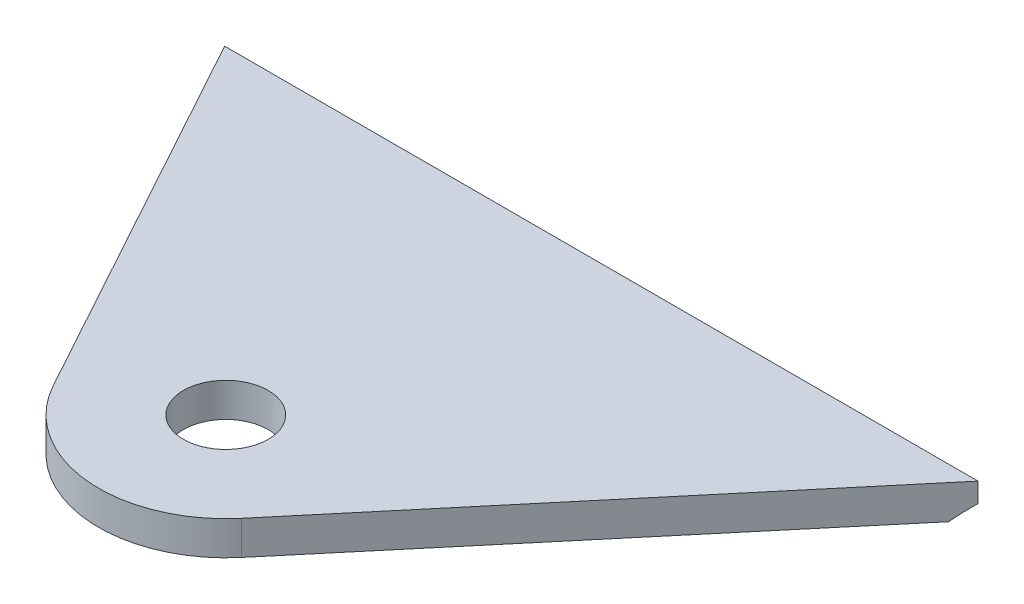
ISO-10303-21;
HEADER;
FILE_DESCRIPTION(('STEP AP214'),'2;1');
FILE_NAME('part.step','',(''),(''),'','','');
FILE_SCHEMA(('AUTOMOTIVE_DESIGN { 1 0 10303 214 1 1 1 1 }'));
ENDSEC;
DATA;
#1=APPLICATION_CONTEXT('core data for automotive mechanical design processes');
#2=APPLICATION_PROTOCOL_DEFINITION('international standard','automotive_design',2000,#1);
#3=PRODUCT_CONTEXT('',#1,'mechanical');
#4=PRODUCT('Part','Part','',(#3));
#5=PRODUCT_RELATED_PRODUCT_CATEGORY('part','',(#4));
#6=PRODUCT_DEFINITION_FORMATION('','',#4);
#7=PRODUCT_DEFINITION_CONTEXT('part definition',#1,'design');
#8=PRODUCT_DEFINITION('design','',#6,#7);
#9=PRODUCT_DEFINITION_SHAPE('','',#8);
#10=(LENGTH_UNIT() NAMED_UNIT(*) SI_UNIT(.MILLI.,.METRE.));
#11=(NAMED_UNIT(*) PLANE_ANGLE_UNIT() SI_UNIT($,.RADIAN.));
#12=(NAMED_UNIT(*) SI_UNIT($,.STERADIAN.) SOLID_ANGLE_UNIT());
#13=UNCERTAINTY_MEASURE_WITH_UNIT(LENGTH_MEASURE(1.E-05),#10,'distance_accuracy_value','');
#14=(GEOMETRIC_REPRESENTATION_CONTEXT(3) GLOBAL_UNCERTAINTY_ASSIGNED_CONTEXT((#13)) GLOBAL_UNIT_ASSIGNED_CONTEXT((#10,
#11,#12)) REPRESENTATION_CONTEXT('',''));
#15=CARTESIAN_POINT('',(0.,0.,0.));
#16=DIRECTION('',(0.,0.,1.));
#17=DIRECTION('',(1.,0.,0.));
#18=AXIS2_PLACEMENT_3D('',#15,#16,#17);
#19=CARTESIAN_POINT('',(161.740285894665,342.9,247.65));
#20=DIRECTION('',(-1.,0.,0.));
#21=DIRECTION('',(0.,-1.,0.));
#22=AXIS2_PLACEMENT_3D('',#19,#20,#21);
#23=CYLINDRICAL_SURFACE('',#22,12.7);
#24=DIRECTION('',(-1.,0.,0.));
#25=VECTOR('',#24,1.);
#26=CARTESIAN_POINT('',(161.740285894665,351.79,256.719614104249));
#27=LINE('',#26,#25);
#28=CARTESIAN_POINT('',(-146.334892129027,351.79,256.719614104249));
#29=VERTEX_POINT('',#28);
#30=CARTESIAN_POINT('',(-201.105883372565,351.79,256.719614104249));
#31=VERTEX_POINT('',#30);
#32=EDGE_CURVE('E11',#29,#31,#27,.T.);
#33=ORIENTED_EDGE('',*,*,#32,.T.);
#34=CARTESIAN_POINT('',(-206.081219294315,342.9,247.65));
#35=DIRECTION('',(-0.876744070446818,0.,0.480957206969967));
#36=DIRECTION('',(-0.480957206969965,0.,-0.876744070446815));
#37=AXIS2_PLACEMENT_3D('',#34,#35,#36);
#38=ELLIPSE('',#37,14.4854130505013,12.7);
#39=CARTESIAN_POINT('',(-201.761763736718,352.864442984934,255.524));
#40=VERTEX_POINT('',#39);
#41=EDGE_CURVE('E49',#40,#31,#38,.F.);
#42=ORIENTED_EDGE('',*,*,#41,.F.);
#43=DIRECTION('',(-1.,0.,0.));
#44=VECTOR('',#43,1.);
#45=CARTESIAN_POINT('',(161.740285894665,352.864442984934,255.524));
#46=LINE('',#45,#44);
#47=CARTESIAN_POINT('',(-145.331652775121,352.864442984934,255.524));
#48=VERTEX_POINT('',#47);
#49=EDGE_CURVE('E123',#48,#40,#46,.T.);
#50=ORIENTED_EDGE('',*,*,#49,.F.);
#51=CARTESIAN_POINT('',(-138.724582279231,342.9,247.65));
#52=DIRECTION('',(0.766044443118977,0.,0.642787609686545));
#53=DIRECTION('',(-0.642787609686543,0.,0.766044443118975));
#54=AXIS2_PLACEMENT_3D('',#51,#52,#53);
#55=ELLIPSE('',#54,16.5786725745199,12.7);
#56=EDGE_CURVE('E37',#29,#48,#55,.F.);
#57=ORIENTED_EDGE('',*,*,#56,.F.);
#58=EDGE_LOOP('',(#33,#42,#50,#57));
#59=FACE_BOUND('',#58,.T.);
#60=ADVANCED_FACE('F34',(#59),#23,.F.);
#61=CARTESIAN_POINT('',(-145.331652775121,354.33,255.524));
#62=DIRECTION('',(0.766044443118977,0.,0.642787609686545));
#63=DIRECTION('',(0.642787609686546,0.,-0.766044443118977));
#64=AXIS2_PLACEMENT_3D('',#61,#62,#63);
#65=PLANE('',#64);
#66=DIRECTION('',(-0.642787609686546,0.,0.766044443118977));
#67=VECTOR('',#66,1.);
#68=CARTESIAN_POINT('',(-145.331652775121,351.79,255.524));
#69=LINE('',#68,#67);
#70=CARTESIAN_POINT('',(-170.503426679292,351.79,285.522551982264));
#71=VERTEX_POINT('',#70);
#72=EDGE_CURVE('E105',#29,#71,#69,.T.);
#73=ORIENTED_EDGE('',*,*,#72,.F.);
#74=ORIENTED_EDGE('',*,*,#56,.T.);
#75=DIRECTION('',(0.,-1.,0.));
#76=VECTOR('',#75,1.);
#77=CARTESIAN_POINT('',(-145.331652775121,354.33,255.524));
#78=LINE('',#77,#76);
#79=CARTESIAN_POINT('',(-145.331652775121,354.33,255.524));
#80=VERTEX_POINT('',#79);
#81=EDGE_CURVE('E119',#80,#48,#78,.T.);
#82=ORIENTED_EDGE('',*,*,#81,.F.);
#83=DIRECTION('',(-0.642787609686546,0.,0.766044443118977));
#84=VECTOR('',#83,1.);
#85=CARTESIAN_POINT('',(-145.331652775121,354.33,255.524));
#86=LINE('',#85,#84);
#87=CARTESIAN_POINT('',(-170.503426679292,354.33,285.522551982264));
#88=VERTEX_POINT('',#87);
#89=EDGE_CURVE('E90',#80,#88,#86,.T.);
#90=ORIENTED_EDGE('',*,*,#89,.T.);
#91=DIRECTION('',(0.,-1.,0.));
#92=VECTOR('',#91,1.);
#93=CARTESIAN_POINT('',(-170.503426679292,354.33,285.522551982264));
#94=LINE('',#93,#92);
#95=EDGE_CURVE('E104',#88,#71,#94,.T.);
#96=ORIENTED_EDGE('',*,*,#95,.T.);
#97=EDGE_LOOP('',(#73,#74,#82,#90,#96));
#98=FACE_BOUND('',#97,.T.);
#99=ADVANCED_FACE('F127',(#98),#65,.T.);
#100=CARTESIAN_POINT('',(-201.761763736718,354.33,255.524));
#101=DIRECTION('',(0.,0.,-1.));
#102=DIRECTION('',(0.,1.,0.));
#103=AXIS2_PLACEMENT_3D('',#100,#101,#102);
#104=PLANE('',#103);
#105=ORIENTED_EDGE('',*,*,#81,.T.);
#106=ORIENTED_EDGE('',*,*,#49,.T.);
#107=DIRECTION('',(0.,-1.,0.));
#108=VECTOR('',#107,1.);
#109=CARTESIAN_POINT('',(-201.761763736718,354.33,255.524));
#110=LINE('',#109,#108);
#111=CARTESIAN_POINT('',(-201.761763736718,354.33,255.524));
#112=VERTEX_POINT('',#111);
#113=EDGE_CURVE('E89',#112,#40,#110,.T.);
#114=ORIENTED_EDGE('',*,*,#113,.F.);
#115=DIRECTION('',(1.,0.,0.));
#116=VECTOR('',#115,1.);
#117=CARTESIAN_POINT('',(-201.761763736718,354.33,255.524));
#118=LINE('',#117,#116);
#119=EDGE_CURVE('E100',#112,#80,#118,.T.);
#120=ORIENTED_EDGE('',*,*,#119,.T.);
#121=EDGE_LOOP('',(#105,#106,#114,#120));
#122=FACE_BOUND('',#121,.T.);
#123=ADVANCED_FACE('F128',(#122),#104,.T.);
#124=CARTESIAN_POINT('',(-186.150987271006,354.33,283.981117396389));
#125=DIRECTION('',(-0.876744070446818,0.,0.480957206969967));
#126=DIRECTION('',(0.480957206969967,0.,0.876744070446817));
#127=AXIS2_PLACEMENT_3D('',#124,#125,#126);
#128=PLANE('',#127);
#129=ORIENTED_EDGE('',*,*,#113,.T.);
#130=ORIENTED_EDGE('',*,*,#41,.T.);
#131=DIRECTION('',(-0.480957206969967,0.,-0.876744070446818));
#132=VECTOR('',#131,1.);
#133=CARTESIAN_POINT('',(-186.150987271006,351.79,283.981117396389));
#134=LINE('',#133,#132);
#135=CARTESIAN_POINT('',(-186.150987271006,351.79,283.981117396389));
#136=VERTEX_POINT('',#135);
#137=EDGE_CURVE('E84',#136,#31,#134,.T.);
#138=ORIENTED_EDGE('',*,*,#137,.F.);
#139=DIRECTION('',(0.,-1.,0.));
#140=VECTOR('',#139,1.);
#141=CARTESIAN_POINT('',(-186.150987271006,354.33,283.981117396389));
#142=LINE('',#141,#140);
#143=CARTESIAN_POINT('',(-186.150987271006,354.33,283.981117396389));
#144=VERTEX_POINT('',#143);
#145=EDGE_CURVE('E79',#144,#136,#142,.T.);
#146=ORIENTED_EDGE('',*,*,#145,.F.);
#147=DIRECTION('',(-0.480957206969967,0.,-0.876744070446818));
#148=VECTOR('',#147,1.);
#149=CARTESIAN_POINT('',(-186.150987271006,354.33,283.981117396389));
#150=LINE('',#149,#148);
#151=EDGE_CURVE('E82',#144,#112,#150,.T.);
#152=ORIENTED_EDGE('',*,*,#151,.T.);
#153=EDGE_LOOP('',(#129,#130,#138,#146,#152));
#154=FACE_BOUND('',#153,.T.);
#155=ADVANCED_FACE('F81',(#154),#128,.T.);
#156=CARTESIAN_POINT('',(-177.8,351.79,279.4));
#157=DIRECTION('',(0.,1.,0.));
#158=DIRECTION('',(-1.,0.,0.));
#159=AXIS2_PLACEMENT_3D('',#156,#157,#158);
#160=PLANE('',#159);
#161=CARTESIAN_POINT('',(-177.8,351.79,279.4));
#162=DIRECTION('',(0.,-1.,0.));
#163=DIRECTION('',(1.,0.,0.));
#164=AXIS2_PLACEMENT_3D('',#161,#162,#163);
#165=CIRCLE('',#164,3.175);
#166=CARTESIAN_POINT('',(-174.625,351.79,279.4));
#167=VERTEX_POINT('',#166);
#168=EDGE_CURVE('E109',#167,#167,#165,.T.);
#169=ORIENTED_EDGE('',*,*,#168,.F.);
#170=EDGE_LOOP('',(#169));
#171=FACE_BOUND('',#170,.T.);
#172=ORIENTED_EDGE('',*,*,#32,.F.);
#173=ORIENTED_EDGE('',*,*,#72,.T.);
#174=CARTESIAN_POINT('',(-177.8,351.79,279.4));
#175=DIRECTION('',(0.,-1.,0.));
#176=DIRECTION('',(-1.,0.,0.));
#177=AXIS2_PLACEMENT_3D('',#174,#175,#176);
#178=CIRCLE('',#177,9.52500000000002);
#179=EDGE_CURVE('E114',#71,#136,#178,.T.);
#180=ORIENTED_EDGE('',*,*,#179,.T.);
#181=ORIENTED_EDGE('',*,*,#137,.T.);
#182=EDGE_LOOP('',(#172,#173,#180,#181));
#183=FACE_BOUND('',#182,.T.);
#184=ADVANCED_FACE('F130',(#171,#183),#160,.F.);
#185=CARTESIAN_POINT('',(-177.8,354.33,279.4));
#186=DIRECTION('',(0.,-1.,0.));
#187=DIRECTION('',(1.,0.,0.));
#188=AXIS2_PLACEMENT_3D('',#185,#186,#187);
#189=CYLINDRICAL_SURFACE('',#188,9.52500000000002);
#190=ORIENTED_EDGE('',*,*,#179,.F.);
#191=ORIENTED_EDGE('',*,*,#95,.F.);
#192=CARTESIAN_POINT('',(-177.8,354.33,279.4));
#193=DIRECTION('',(0.,-1.,0.));
#194=DIRECTION('',(-1.,0.,0.));
#195=AXIS2_PLACEMENT_3D('',#192,#193,#194);
#196=CIRCLE('',#195,9.52500000000002);
#197=EDGE_CURVE('E97',#88,#144,#196,.T.);
#198=ORIENTED_EDGE('',*,*,#197,.T.);
#199=ORIENTED_EDGE('',*,*,#145,.T.);
#200=EDGE_LOOP('',(#190,#191,#198,#199));
#201=FACE_BOUND('',#200,.T.);
#202=ADVANCED_FACE('F102',(#201),#189,.T.);
#203=CARTESIAN_POINT('',(-177.8,354.33,279.4));
#204=DIRECTION('',(0.,1.,0.));
#205=DIRECTION('',(-1.,0.,0.));
#206=AXIS2_PLACEMENT_3D('',#203,#204,#205);
#207=PLANE('',#206);
#208=CARTESIAN_POINT('',(-177.8,354.33,279.4));
#209=DIRECTION('',(0.,-1.,0.));
#210=DIRECTION('',(1.,0.,0.));
#211=AXIS2_PLACEMENT_3D('',#208,#209,#210);
#212=CIRCLE('',#211,3.175);
#213=CARTESIAN_POINT('',(-174.625,354.33,279.4));
#214=VERTEX_POINT('',#213);
#215=EDGE_CURVE('E116',#214,#214,#212,.T.);
#216=ORIENTED_EDGE('',*,*,#215,.T.);
#217=EDGE_LOOP('',(#216));
#218=FACE_BOUND('',#217,.T.);
#219=ORIENTED_EDGE('',*,*,#197,.F.);
#220=ORIENTED_EDGE('',*,*,#89,.F.);
#221=ORIENTED_EDGE('',*,*,#119,.F.);
#222=ORIENTED_EDGE('',*,*,#151,.F.);
#223=EDGE_LOOP('',(#219,#220,#221,#222));
#224=FACE_BOUND('',#223,.T.);
#225=ADVANCED_FACE('F95',(#218,#224),#207,.T.);
#226=CARTESIAN_POINT('',(-177.8,354.33,279.4));
#227=DIRECTION('',(0.,-1.,0.));
#228=DIRECTION('',(1.,0.,0.));
#229=AXIS2_PLACEMENT_3D('',#226,#227,#228);
#230=CYLINDRICAL_SURFACE('',#229,3.175);
#231=ORIENTED_EDGE('',*,*,#215,.F.);
#232=EDGE_LOOP('',(#231));
#233=FACE_BOUND('',#232,.T.);
#234=ORIENTED_EDGE('',*,*,#168,.T.);
#235=EDGE_LOOP('',(#234));
#236=FACE_BOUND('',#235,.T.);
#237=ADVANCED_FACE('F143',(#233,#236),#230,.F.);
#238=CLOSED_SHELL('',(#60,#99,#123,#155,#184,#202,#225,#237));
#239=MANIFOLD_SOLID_BREP('B2',#238);
#240=ADVANCED_BREP_SHAPE_REPRESENTATION('',(#18,#239),#14);
#241=SHAPE_DEFINITION_REPRESENTATION(#9,#240);
ENDSEC;
END-ISO-10303-21;
